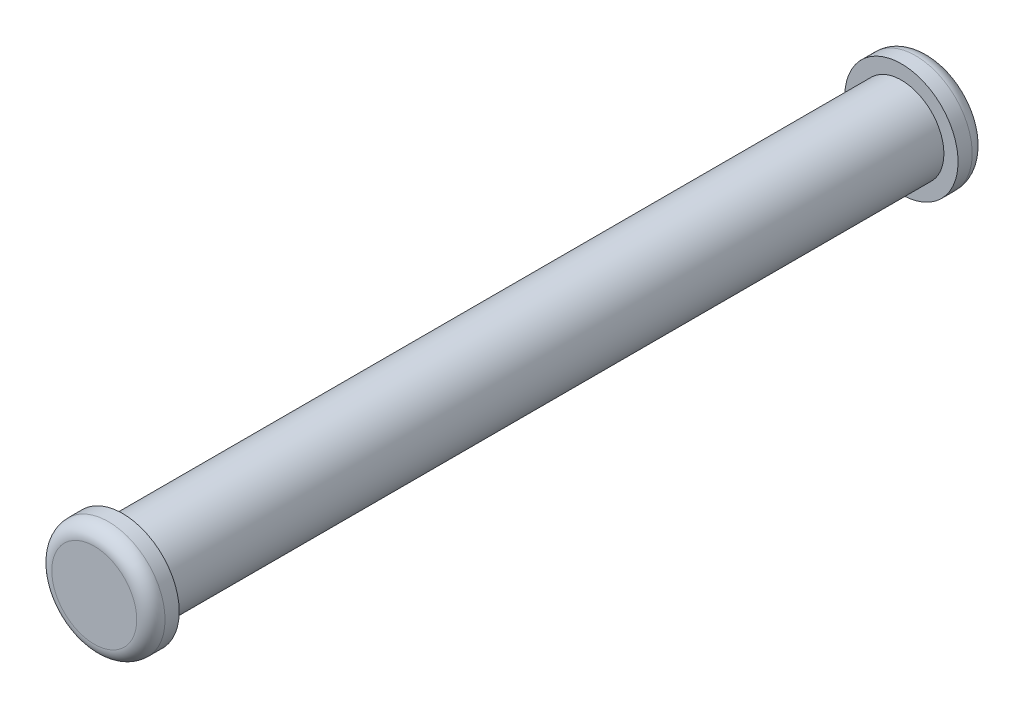
ISO-10303-21;
HEADER;
FILE_DESCRIPTION(('STEP AP214'),'2;1');
FILE_NAME('part.step','',(''),(''),'','','');
FILE_SCHEMA(('AUTOMOTIVE_DESIGN { 1 0 10303 214 1 1 1 1 }'));
ENDSEC;
DATA;
#1=APPLICATION_CONTEXT('core data for automotive mechanical design processes');
#2=APPLICATION_PROTOCOL_DEFINITION('international standard','automotive_design',2000,#1);
#3=PRODUCT_CONTEXT('',#1,'mechanical');
#4=PRODUCT('Part','Part','',(#3));
#5=PRODUCT_RELATED_PRODUCT_CATEGORY('part','',(#4));
#6=PRODUCT_DEFINITION_FORMATION('','',#4);
#7=PRODUCT_DEFINITION_CONTEXT('part definition',#1,'design');
#8=PRODUCT_DEFINITION('design','',#6,#7);
#9=PRODUCT_DEFINITION_SHAPE('','',#8);
#10=(LENGTH_UNIT() NAMED_UNIT(*) SI_UNIT(.MILLI.,.METRE.));
#11=(NAMED_UNIT(*) PLANE_ANGLE_UNIT() SI_UNIT($,.RADIAN.));
#12=(NAMED_UNIT(*) SI_UNIT($,.STERADIAN.) SOLID_ANGLE_UNIT());
#13=UNCERTAINTY_MEASURE_WITH_UNIT(LENGTH_MEASURE(1.E-05),#10,'distance_accuracy_value','');
#14=(GEOMETRIC_REPRESENTATION_CONTEXT(3) GLOBAL_UNCERTAINTY_ASSIGNED_CONTEXT((#13)) GLOBAL_UNIT_ASSIGNED_CONTEXT((#10,
#11,#12)) REPRESENTATION_CONTEXT('',''));
#15=CARTESIAN_POINT('',(0.,0.,0.));
#16=DIRECTION('',(0.,0.,1.));
#17=DIRECTION('',(1.,0.,0.));
#18=AXIS2_PLACEMENT_3D('',#15,#16,#17);
#19=CARTESIAN_POINT('',(0.,0.,27.5));
#20=DIRECTION('',(0.,0.,-1.));
#21=DIRECTION('',(-1.,0.,0.));
#22=AXIS2_PLACEMENT_3D('',#19,#20,#21);
#23=CYLINDRICAL_SURFACE('',#22,1.5);
#24=CARTESIAN_POINT('',(0.,0.,27.5));
#25=DIRECTION('',(0.,0.,1.));
#26=DIRECTION('',(1.,0.,0.));
#27=AXIS2_PLACEMENT_3D('',#24,#25,#26);
#28=CIRCLE('',#27,1.5);
#29=CARTESIAN_POINT('',(1.5,0.,27.5));
#30=VERTEX_POINT('',#29);
#31=EDGE_CURVE('E59',#30,#30,#28,.T.);
#32=ORIENTED_EDGE('',*,*,#31,.F.);
#33=EDGE_LOOP('',(#32));
#34=FACE_BOUND('',#33,.T.);
#35=CARTESIAN_POINT('',(0.,0.,0.));
#36=DIRECTION('',(0.,0.,1.));
#37=DIRECTION('',(1.,0.,0.));
#38=AXIS2_PLACEMENT_3D('',#35,#36,#37);
#39=CIRCLE('',#38,1.5);
#40=CARTESIAN_POINT('',(1.5,0.,0.));
#41=VERTEX_POINT('',#40);
#42=EDGE_CURVE('E60',#41,#41,#39,.T.);
#43=ORIENTED_EDGE('',*,*,#42,.T.);
#44=EDGE_LOOP('',(#43));
#45=FACE_BOUND('',#44,.T.);
#46=ADVANCED_FACE('F39',(#34,#45),#23,.T.);
#47=CARTESIAN_POINT('',(0.,0.,-1.));
#48=DIRECTION('',(0.,0.,1.));
#49=DIRECTION('',(1.,0.,0.));
#50=AXIS2_PLACEMENT_3D('',#47,#48,#49);
#51=CYLINDRICAL_SURFACE('',#50,2.);
#52=CARTESIAN_POINT('',(0.,0.,-0.5));
#53=DIRECTION('',(0.,0.,-1.));
#54=DIRECTION('',(-1.,0.,0.));
#55=AXIS2_PLACEMENT_3D('',#52,#53,#54);
#56=CIRCLE('',#55,2.);
#57=CARTESIAN_POINT('',(-2.,0.,-0.5));
#58=VERTEX_POINT('',#57);
#59=EDGE_CURVE('E50',#58,#58,#56,.F.);
#60=ORIENTED_EDGE('',*,*,#59,.T.);
#61=EDGE_LOOP('',(#60));
#62=FACE_BOUND('',#61,.T.);
#63=CARTESIAN_POINT('',(0.,0.,0.));
#64=DIRECTION('',(0.,0.,-1.));
#65=DIRECTION('',(-1.,0.,0.));
#66=AXIS2_PLACEMENT_3D('',#63,#64,#65);
#67=CIRCLE('',#66,2.);
#68=CARTESIAN_POINT('',(-2.,0.,0.));
#69=VERTEX_POINT('',#68);
#70=EDGE_CURVE('E63',#69,#69,#67,.T.);
#71=ORIENTED_EDGE('',*,*,#70,.T.);
#72=EDGE_LOOP('',(#71));
#73=FACE_BOUND('',#72,.T.);
#74=ADVANCED_FACE('F90',(#62,#73),#51,.T.);
#75=CARTESIAN_POINT('',(0.,0.,-1.));
#76=DIRECTION('',(0.,0.,-1.));
#77=DIRECTION('',(-1.,0.,0.));
#78=AXIS2_PLACEMENT_3D('',#75,#76,#77);
#79=PLANE('',#78);
#80=CARTESIAN_POINT('',(0.,0.,-1.));
#81=DIRECTION('',(0.,0.,-1.));
#82=DIRECTION('',(-1.,0.,0.));
#83=AXIS2_PLACEMENT_3D('',#80,#81,#82);
#84=CIRCLE('',#83,1.5);
#85=CARTESIAN_POINT('',(-1.5,0.,-1.));
#86=VERTEX_POINT('',#85);
#87=EDGE_CURVE('E54',#86,#86,#84,.T.);
#88=ORIENTED_EDGE('',*,*,#87,.T.);
#89=EDGE_LOOP('',(#88));
#90=FACE_BOUND('',#89,.T.);
#91=ADVANCED_FACE('F95',(#90),#79,.T.);
#92=CARTESIAN_POINT('',(0.,0.,0.));
#93=DIRECTION('',(0.,0.,-1.));
#94=DIRECTION('',(-1.,0.,0.));
#95=AXIS2_PLACEMENT_3D('',#92,#93,#94);
#96=PLANE('',#95);
#97=ORIENTED_EDGE('',*,*,#42,.F.);
#98=EDGE_LOOP('',(#97));
#99=FACE_BOUND('',#98,.T.);
#100=ORIENTED_EDGE('',*,*,#70,.F.);
#101=EDGE_LOOP('',(#100));
#102=FACE_BOUND('',#101,.T.);
#103=ADVANCED_FACE('F101',(#99,#102),#96,.F.);
#104=CARTESIAN_POINT('',(0.,0.,28.5));
#105=DIRECTION('',(0.,0.,-1.));
#106=DIRECTION('',(-1.,0.,0.));
#107=AXIS2_PLACEMENT_3D('',#104,#105,#106);
#108=CYLINDRICAL_SURFACE('',#107,2.);
#109=CARTESIAN_POINT('',(0.,0.,28.));
#110=DIRECTION('',(0.,0.,1.));
#111=DIRECTION('',(1.,0.,0.));
#112=AXIS2_PLACEMENT_3D('',#109,#110,#111);
#113=CIRCLE('',#112,2.);
#114=CARTESIAN_POINT('',(2.,0.,28.));
#115=VERTEX_POINT('',#114);
#116=EDGE_CURVE('E10',#115,#115,#113,.F.);
#117=ORIENTED_EDGE('',*,*,#116,.T.);
#118=EDGE_LOOP('',(#117));
#119=FACE_BOUND('',#118,.T.);
#120=CARTESIAN_POINT('',(0.,0.,27.5));
#121=DIRECTION('',(0.,0.,1.));
#122=DIRECTION('',(1.,0.,0.));
#123=AXIS2_PLACEMENT_3D('',#120,#121,#122);
#124=CIRCLE('',#123,2.);
#125=CARTESIAN_POINT('',(2.,0.,27.5));
#126=VERTEX_POINT('',#125);
#127=EDGE_CURVE('E68',#126,#126,#124,.T.);
#128=ORIENTED_EDGE('',*,*,#127,.T.);
#129=EDGE_LOOP('',(#128));
#130=FACE_BOUND('',#129,.T.);
#131=ADVANCED_FACE('F72',(#119,#130),#108,.T.);
#132=CARTESIAN_POINT('',(0.,0.,28.5));
#133=DIRECTION('',(0.,0.,1.));
#134=DIRECTION('',(1.,0.,0.));
#135=AXIS2_PLACEMENT_3D('',#132,#133,#134);
#136=PLANE('',#135);
#137=CARTESIAN_POINT('',(0.,0.,28.5));
#138=DIRECTION('',(0.,0.,1.));
#139=DIRECTION('',(1.,0.,0.));
#140=AXIS2_PLACEMENT_3D('',#137,#138,#139);
#141=CIRCLE('',#140,1.5);
#142=CARTESIAN_POINT('',(1.5,0.,28.5));
#143=VERTEX_POINT('',#142);
#144=EDGE_CURVE('E46',#143,#143,#141,.T.);
#145=ORIENTED_EDGE('',*,*,#144,.T.);
#146=EDGE_LOOP('',(#145));
#147=FACE_BOUND('',#146,.T.);
#148=ADVANCED_FACE('F77',(#147),#136,.T.);
#149=CARTESIAN_POINT('',(0.,0.,27.5));
#150=DIRECTION('',(0.,0.,1.));
#151=DIRECTION('',(1.,0.,0.));
#152=AXIS2_PLACEMENT_3D('',#149,#150,#151);
#153=PLANE('',#152);
#154=ORIENTED_EDGE('',*,*,#31,.T.);
#155=EDGE_LOOP('',(#154));
#156=FACE_BOUND('',#155,.T.);
#157=ORIENTED_EDGE('',*,*,#127,.F.);
#158=EDGE_LOOP('',(#157));
#159=FACE_BOUND('',#158,.T.);
#160=ADVANCED_FACE('F74',(#156,#159),#153,.F.);
#161=CARTESIAN_POINT('',(0.,0.,-0.5));
#162=DIRECTION('',(0.,0.,-1.));
#163=DIRECTION('',(-1.,0.,0.));
#164=AXIS2_PLACEMENT_3D('',#161,#162,#163);
#165=TOROIDAL_SURFACE('',#164,1.5,0.5);
#166=ORIENTED_EDGE('',*,*,#59,.F.);
#167=EDGE_LOOP('',(#166));
#168=FACE_BOUND('',#167,.T.);
#169=ORIENTED_EDGE('',*,*,#87,.F.);
#170=EDGE_LOOP('',(#169));
#171=FACE_BOUND('',#170,.T.);
#172=ADVANCED_FACE('F76',(#168,#171),#165,.T.);
#173=CARTESIAN_POINT('',(0.,0.,28.));
#174=DIRECTION('',(0.,0.,1.));
#175=DIRECTION('',(1.,0.,0.));
#176=AXIS2_PLACEMENT_3D('',#173,#174,#175);
#177=TOROIDAL_SURFACE('',#176,1.5,0.5);
#178=ORIENTED_EDGE('',*,*,#116,.F.);
#179=EDGE_LOOP('',(#178));
#180=FACE_BOUND('',#179,.T.);
#181=ORIENTED_EDGE('',*,*,#144,.F.);
#182=EDGE_LOOP('',(#181));
#183=FACE_BOUND('',#182,.T.);
#184=ADVANCED_FACE('F41',(#180,#183),#177,.T.);
#185=CLOSED_SHELL('',(#46,#74,#91,#103,#131,#148,#160,#172,#184));
#186=MANIFOLD_SOLID_BREP('B2',#185);
#187=ADVANCED_BREP_SHAPE_REPRESENTATION('',(#18,#186),#14);
#188=SHAPE_DEFINITION_REPRESENTATION(#9,#187);
ENDSEC;
END-ISO-10303-21;
